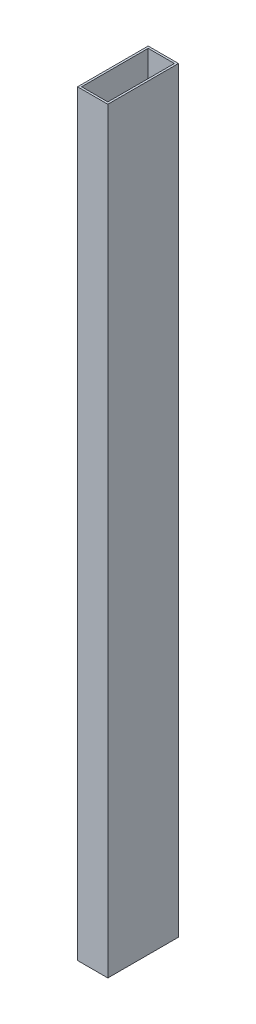
ISO-10303-21;
HEADER;
FILE_DESCRIPTION(('STEP AP214'),'2;1');
FILE_NAME('part.step','',(''),(''),'','','');
FILE_SCHEMA(('AUTOMOTIVE_DESIGN { 1 0 10303 214 1 1 1 1 }'));
ENDSEC;
DATA;
#1=APPLICATION_CONTEXT('core data for automotive mechanical design processes');
#2=APPLICATION_PROTOCOL_DEFINITION('international standard','automotive_design',2000,#1);
#3=PRODUCT_CONTEXT('',#1,'mechanical');
#4=PRODUCT('Part','Part','',(#3));
#5=PRODUCT_RELATED_PRODUCT_CATEGORY('part','',(#4));
#6=PRODUCT_DEFINITION_FORMATION('','',#4);
#7=PRODUCT_DEFINITION_CONTEXT('part definition',#1,'design');
#8=PRODUCT_DEFINITION('design','',#6,#7);
#9=PRODUCT_DEFINITION_SHAPE('','',#8);
#10=(LENGTH_UNIT() NAMED_UNIT(*) SI_UNIT(.MILLI.,.METRE.));
#11=(NAMED_UNIT(*) PLANE_ANGLE_UNIT() SI_UNIT($,.RADIAN.));
#12=(NAMED_UNIT(*) SI_UNIT($,.STERADIAN.) SOLID_ANGLE_UNIT());
#13=UNCERTAINTY_MEASURE_WITH_UNIT(LENGTH_MEASURE(1.E-05),#10,'distance_accuracy_value','');
#14=(GEOMETRIC_REPRESENTATION_CONTEXT(3) GLOBAL_UNCERTAINTY_ASSIGNED_CONTEXT((#13)) GLOBAL_UNIT_ASSIGNED_CONTEXT((#10,
#11,#12)) REPRESENTATION_CONTEXT('',''));
#15=CARTESIAN_POINT('',(0.,0.,0.));
#16=DIRECTION('',(0.,0.,1.));
#17=DIRECTION('',(1.,0.,0.));
#18=AXIS2_PLACEMENT_3D('',#15,#16,#17);
#19=CARTESIAN_POINT('',(-15.,-375.,70.));
#20=DIRECTION('',(1.,0.,0.));
#21=DIRECTION('',(0.,1.,0.));
#22=AXIS2_PLACEMENT_3D('',#19,#20,#21);
#23=PLANE('',#22);
#24=DIRECTION('',(0.,-1.,0.));
#25=VECTOR('',#24,1.);
#26=CARTESIAN_POINT('',(-15.,-375.,0.));
#27=LINE('',#26,#25);
#28=CARTESIAN_POINT('',(-15.,375.,0.));
#29=VERTEX_POINT('',#28);
#30=CARTESIAN_POINT('',(-15.,-375.,0.));
#31=VERTEX_POINT('',#30);
#32=EDGE_CURVE('E135',#29,#31,#27,.T.);
#33=ORIENTED_EDGE('',*,*,#32,.T.);
#34=DIRECTION('',(0.,0.,-1.));
#35=VECTOR('',#34,1.);
#36=CARTESIAN_POINT('',(-15.,-375.,70.));
#37=LINE('',#36,#35);
#38=CARTESIAN_POINT('',(-15.,-375.,70.));
#39=VERTEX_POINT('',#38);
#40=EDGE_CURVE('E11',#39,#31,#37,.T.);
#41=ORIENTED_EDGE('',*,*,#40,.F.);
#42=DIRECTION('',(0.,-1.,0.));
#43=VECTOR('',#42,1.);
#44=CARTESIAN_POINT('',(-15.,-375.,70.));
#45=LINE('',#44,#43);
#46=CARTESIAN_POINT('',(-15.,375.,70.));
#47=VERTEX_POINT('',#46);
#48=EDGE_CURVE('E139',#47,#39,#45,.T.);
#49=ORIENTED_EDGE('',*,*,#48,.F.);
#50=DIRECTION('',(0.,0.,-1.));
#51=VECTOR('',#50,1.);
#52=CARTESIAN_POINT('',(-15.,375.,70.));
#53=LINE('',#52,#51);
#54=EDGE_CURVE('E149',#47,#29,#53,.T.);
#55=ORIENTED_EDGE('',*,*,#54,.T.);
#56=EDGE_LOOP('',(#33,#41,#49,#55));
#57=FACE_BOUND('',#56,.T.);
#58=ADVANCED_FACE('F39',(#57),#23,.F.);
#59=CARTESIAN_POINT('',(15.,-375.,70.));
#60=DIRECTION('',(0.,1.,0.));
#61=DIRECTION('',(0.,0.,1.));
#62=AXIS2_PLACEMENT_3D('',#59,#60,#61);
#63=PLANE('',#62);
#64=DIRECTION('',(0.,0.,-1.));
#65=VECTOR('',#64,1.);
#66=CARTESIAN_POINT('',(13.,-375.,68.));
#67=LINE('',#66,#65);
#68=CARTESIAN_POINT('',(13.,-375.,68.));
#69=VERTEX_POINT('',#68);
#70=CARTESIAN_POINT('',(13.,-375.,2.));
#71=VERTEX_POINT('',#70);
#72=EDGE_CURVE('E129',#69,#71,#67,.T.);
#73=ORIENTED_EDGE('',*,*,#72,.T.);
#74=DIRECTION('',(1.,0.,0.));
#75=VECTOR('',#74,1.);
#76=CARTESIAN_POINT('',(-13.,-375.,2.));
#77=LINE('',#76,#75);
#78=CARTESIAN_POINT('',(-13.,-375.,2.));
#79=VERTEX_POINT('',#78);
#80=EDGE_CURVE('E53',#79,#71,#77,.T.);
#81=ORIENTED_EDGE('',*,*,#80,.F.);
#82=DIRECTION('',(0.,0.,-1.));
#83=VECTOR('',#82,1.);
#84=CARTESIAN_POINT('',(-13.,-375.,68.));
#85=LINE('',#84,#83);
#86=CARTESIAN_POINT('',(-13.,-375.,68.));
#87=VERTEX_POINT('',#86);
#88=EDGE_CURVE('E120',#87,#79,#85,.T.);
#89=ORIENTED_EDGE('',*,*,#88,.F.);
#90=DIRECTION('',(1.,0.,0.));
#91=VECTOR('',#90,1.);
#92=CARTESIAN_POINT('',(-13.,-375.,68.));
#93=LINE('',#92,#91);
#94=EDGE_CURVE('E123',#87,#69,#93,.T.);
#95=ORIENTED_EDGE('',*,*,#94,.T.);
#96=EDGE_LOOP('',(#73,#81,#89,#95));
#97=FACE_BOUND('',#96,.T.);
#98=DIRECTION('',(1.,0.,0.));
#99=VECTOR('',#98,1.);
#100=CARTESIAN_POINT('',(15.,-375.,0.));
#101=LINE('',#100,#99);
#102=CARTESIAN_POINT('',(15.,-375.,0.));
#103=VERTEX_POINT('',#102);
#104=EDGE_CURVE('E152',#31,#103,#101,.T.);
#105=ORIENTED_EDGE('',*,*,#104,.T.);
#106=DIRECTION('',(0.,0.,-1.));
#107=VECTOR('',#106,1.);
#108=CARTESIAN_POINT('',(15.,-375.,70.));
#109=LINE('',#108,#107);
#110=CARTESIAN_POINT('',(15.,-375.,70.));
#111=VERTEX_POINT('',#110);
#112=EDGE_CURVE('E46',#111,#103,#109,.T.);
#113=ORIENTED_EDGE('',*,*,#112,.F.);
#114=DIRECTION('',(1.,0.,0.));
#115=VECTOR('',#114,1.);
#116=CARTESIAN_POINT('',(15.,-375.,70.));
#117=LINE('',#116,#115);
#118=EDGE_CURVE('E142',#39,#111,#117,.T.);
#119=ORIENTED_EDGE('',*,*,#118,.F.);
#120=ORIENTED_EDGE('',*,*,#40,.T.);
#121=EDGE_LOOP('',(#105,#113,#119,#120));
#122=FACE_BOUND('',#121,.T.);
#123=ADVANCED_FACE('F180',(#97,#122),#63,.F.);
#124=CARTESIAN_POINT('',(15.,-375.,70.));
#125=DIRECTION('',(-1.,0.,0.));
#126=DIRECTION('',(0.,0.,1.));
#127=AXIS2_PLACEMENT_3D('',#124,#125,#126);
#128=PLANE('',#127);
#129=DIRECTION('',(0.,1.,0.));
#130=VECTOR('',#129,1.);
#131=CARTESIAN_POINT('',(15.,-375.,0.));
#132=LINE('',#131,#130);
#133=CARTESIAN_POINT('',(15.,375.,0.));
#134=VERTEX_POINT('',#133);
#135=EDGE_CURVE('E154',#103,#134,#132,.T.);
#136=ORIENTED_EDGE('',*,*,#135,.T.);
#137=DIRECTION('',(0.,0.,-1.));
#138=VECTOR('',#137,1.);
#139=CARTESIAN_POINT('',(15.,375.,70.));
#140=LINE('',#139,#138);
#141=CARTESIAN_POINT('',(15.,375.,70.));
#142=VERTEX_POINT('',#141);
#143=EDGE_CURVE('E159',#142,#134,#140,.T.);
#144=ORIENTED_EDGE('',*,*,#143,.F.);
#145=DIRECTION('',(0.,1.,0.));
#146=VECTOR('',#145,1.);
#147=CARTESIAN_POINT('',(15.,-375.,70.));
#148=LINE('',#147,#146);
#149=EDGE_CURVE('E145',#111,#142,#148,.T.);
#150=ORIENTED_EDGE('',*,*,#149,.F.);
#151=ORIENTED_EDGE('',*,*,#112,.T.);
#152=EDGE_LOOP('',(#136,#144,#150,#151));
#153=FACE_BOUND('',#152,.T.);
#154=ADVANCED_FACE('F166',(#153),#128,.F.);
#155=CARTESIAN_POINT('',(15.,375.,70.));
#156=DIRECTION('',(0.,-1.,0.));
#157=DIRECTION('',(0.,0.,-1.));
#158=AXIS2_PLACEMENT_3D('',#155,#156,#157);
#159=PLANE('',#158);
#160=DIRECTION('',(0.,0.,-1.));
#161=VECTOR('',#160,1.);
#162=CARTESIAN_POINT('',(-13.,375.,68.));
#163=LINE('',#162,#161);
#164=CARTESIAN_POINT('',(-13.,375.,68.));
#165=VERTEX_POINT('',#164);
#166=CARTESIAN_POINT('',(-13.,375.,2.));
#167=VERTEX_POINT('',#166);
#168=EDGE_CURVE('E115',#165,#167,#163,.T.);
#169=ORIENTED_EDGE('',*,*,#168,.T.);
#170=DIRECTION('',(1.,0.,0.));
#171=VECTOR('',#170,1.);
#172=CARTESIAN_POINT('',(-13.,375.,2.));
#173=LINE('',#172,#171);
#174=CARTESIAN_POINT('',(13.,375.,2.));
#175=VERTEX_POINT('',#174);
#176=EDGE_CURVE('E110',#167,#175,#173,.T.);
#177=ORIENTED_EDGE('',*,*,#176,.T.);
#178=DIRECTION('',(0.,0.,-1.));
#179=VECTOR('',#178,1.);
#180=CARTESIAN_POINT('',(13.,375.,68.));
#181=LINE('',#180,#179);
#182=CARTESIAN_POINT('',(13.,375.,68.));
#183=VERTEX_POINT('',#182);
#184=EDGE_CURVE('E102',#183,#175,#181,.T.);
#185=ORIENTED_EDGE('',*,*,#184,.F.);
#186=DIRECTION('',(1.,0.,0.));
#187=VECTOR('',#186,1.);
#188=CARTESIAN_POINT('',(-13.,375.,68.));
#189=LINE('',#188,#187);
#190=EDGE_CURVE('E109',#165,#183,#189,.T.);
#191=ORIENTED_EDGE('',*,*,#190,.F.);
#192=EDGE_LOOP('',(#169,#177,#185,#191));
#193=FACE_BOUND('',#192,.T.);
#194=DIRECTION('',(-1.,0.,0.));
#195=VECTOR('',#194,1.);
#196=CARTESIAN_POINT('',(15.,375.,0.));
#197=LINE('',#196,#195);
#198=EDGE_CURVE('E143',#134,#29,#197,.T.);
#199=ORIENTED_EDGE('',*,*,#198,.T.);
#200=ORIENTED_EDGE('',*,*,#54,.F.);
#201=DIRECTION('',(-1.,0.,0.));
#202=VECTOR('',#201,1.);
#203=CARTESIAN_POINT('',(15.,375.,70.));
#204=LINE('',#203,#202);
#205=EDGE_CURVE('E147',#142,#47,#204,.T.);
#206=ORIENTED_EDGE('',*,*,#205,.F.);
#207=ORIENTED_EDGE('',*,*,#143,.T.);
#208=EDGE_LOOP('',(#199,#200,#206,#207));
#209=FACE_BOUND('',#208,.T.);
#210=ADVANCED_FACE('F117',(#193,#209),#159,.F.);
#211=CARTESIAN_POINT('',(0.,0.,70.));
#212=DIRECTION('',(0.,0.,1.));
#213=DIRECTION('',(1.,0.,0.));
#214=AXIS2_PLACEMENT_3D('',#211,#212,#213);
#215=PLANE('',#214);
#216=ORIENTED_EDGE('',*,*,#48,.T.);
#217=ORIENTED_EDGE('',*,*,#118,.T.);
#218=ORIENTED_EDGE('',*,*,#149,.T.);
#219=ORIENTED_EDGE('',*,*,#205,.T.);
#220=EDGE_LOOP('',(#216,#217,#218,#219));
#221=FACE_BOUND('',#220,.T.);
#222=ADVANCED_FACE('F179',(#221),#215,.T.);
#223=CARTESIAN_POINT('',(0.,0.,0.));
#224=DIRECTION('',(0.,0.,1.));
#225=DIRECTION('',(1.,0.,0.));
#226=AXIS2_PLACEMENT_3D('',#223,#224,#225);
#227=PLANE('',#226);
#228=ORIENTED_EDGE('',*,*,#32,.F.);
#229=ORIENTED_EDGE('',*,*,#198,.F.);
#230=ORIENTED_EDGE('',*,*,#135,.F.);
#231=ORIENTED_EDGE('',*,*,#104,.F.);
#232=EDGE_LOOP('',(#228,#229,#230,#231));
#233=FACE_BOUND('',#232,.T.);
#234=ADVANCED_FACE('F172',(#233),#227,.F.);
#235=CARTESIAN_POINT('',(-13.,375.,2.));
#236=DIRECTION('',(0.,0.,-1.));
#237=DIRECTION('',(-1.,0.,0.));
#238=AXIS2_PLACEMENT_3D('',#235,#236,#237);
#239=PLANE('',#238);
#240=ORIENTED_EDGE('',*,*,#80,.T.);
#241=DIRECTION('',(0.,-1.,0.));
#242=VECTOR('',#241,1.);
#243=CARTESIAN_POINT('',(13.,375.,2.));
#244=LINE('',#243,#242);
#245=EDGE_CURVE('E104',#175,#71,#244,.T.);
#246=ORIENTED_EDGE('',*,*,#245,.F.);
#247=ORIENTED_EDGE('',*,*,#176,.F.);
#248=DIRECTION('',(0.,-1.,0.));
#249=VECTOR('',#248,1.);
#250=CARTESIAN_POINT('',(-13.,375.,2.));
#251=LINE('',#250,#249);
#252=EDGE_CURVE('E133',#167,#79,#251,.T.);
#253=ORIENTED_EDGE('',*,*,#252,.T.);
#254=EDGE_LOOP('',(#240,#246,#247,#253));
#255=FACE_BOUND('',#254,.T.);
#256=ADVANCED_FACE('F113',(#255),#239,.F.);
#257=CARTESIAN_POINT('',(-13.,375.,68.));
#258=DIRECTION('',(-1.,0.,0.));
#259=DIRECTION('',(0.,0.,1.));
#260=AXIS2_PLACEMENT_3D('',#257,#258,#259);
#261=PLANE('',#260);
#262=ORIENTED_EDGE('',*,*,#88,.T.);
#263=ORIENTED_EDGE('',*,*,#252,.F.);
#264=ORIENTED_EDGE('',*,*,#168,.F.);
#265=DIRECTION('',(0.,-1.,0.));
#266=VECTOR('',#265,1.);
#267=CARTESIAN_POINT('',(-13.,375.,68.));
#268=LINE('',#267,#266);
#269=EDGE_CURVE('E136',#165,#87,#268,.T.);
#270=ORIENTED_EDGE('',*,*,#269,.T.);
#271=EDGE_LOOP('',(#262,#263,#264,#270));
#272=FACE_BOUND('',#271,.T.);
#273=ADVANCED_FACE('F197',(#272),#261,.F.);
#274=CARTESIAN_POINT('',(-13.,375.,68.));
#275=DIRECTION('',(0.,0.,-1.));
#276=DIRECTION('',(-1.,0.,0.));
#277=AXIS2_PLACEMENT_3D('',#274,#275,#276);
#278=PLANE('',#277);
#279=ORIENTED_EDGE('',*,*,#94,.F.);
#280=ORIENTED_EDGE('',*,*,#269,.F.);
#281=ORIENTED_EDGE('',*,*,#190,.T.);
#282=DIRECTION('',(0.,-1.,0.));
#283=VECTOR('',#282,1.);
#284=CARTESIAN_POINT('',(13.,375.,68.));
#285=LINE('',#284,#283);
#286=EDGE_CURVE('E61',#183,#69,#285,.T.);
#287=ORIENTED_EDGE('',*,*,#286,.T.);
#288=EDGE_LOOP('',(#279,#280,#281,#287));
#289=FACE_BOUND('',#288,.T.);
#290=ADVANCED_FACE('F200',(#289),#278,.T.);
#291=CARTESIAN_POINT('',(13.,375.,68.));
#292=DIRECTION('',(-1.,0.,0.));
#293=DIRECTION('',(0.,0.,1.));
#294=AXIS2_PLACEMENT_3D('',#291,#292,#293);
#295=PLANE('',#294);
#296=ORIENTED_EDGE('',*,*,#72,.F.);
#297=ORIENTED_EDGE('',*,*,#286,.F.);
#298=ORIENTED_EDGE('',*,*,#184,.T.);
#299=ORIENTED_EDGE('',*,*,#245,.T.);
#300=EDGE_LOOP('',(#296,#297,#298,#299));
#301=FACE_BOUND('',#300,.T.);
#302=ADVANCED_FACE('F103',(#301),#295,.T.);
#303=CLOSED_SHELL('',(#58,#123,#154,#210,#222,#234,#256,#273,#290,#302));
#304=MANIFOLD_SOLID_BREP('B2',#303);
#305=ADVANCED_BREP_SHAPE_REPRESENTATION('',(#18,#304),#14);
#306=SHAPE_DEFINITION_REPRESENTATION(#9,#305);
ENDSEC;
END-ISO-10303-21;
